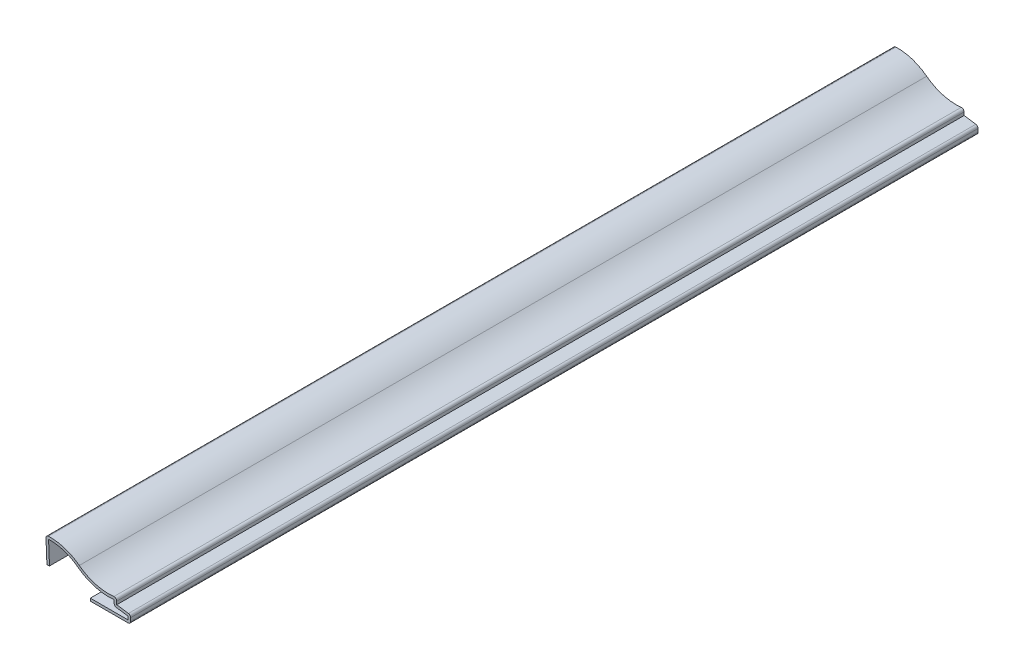
ISO-10303-21;
HEADER;
FILE_DESCRIPTION(('STEP AP214'),'2;1');
FILE_NAME('part.step','',(''),(''),'','','');
FILE_SCHEMA(('AUTOMOTIVE_DESIGN { 1 0 10303 214 1 1 1 1 }'));
ENDSEC;
DATA;
#1=APPLICATION_CONTEXT('core data for automotive mechanical design processes');
#2=APPLICATION_PROTOCOL_DEFINITION('international standard','automotive_design',2000,#1);
#3=PRODUCT_CONTEXT('',#1,'mechanical');
#4=PRODUCT('Part','Part','',(#3));
#5=PRODUCT_RELATED_PRODUCT_CATEGORY('part','',(#4));
#6=PRODUCT_DEFINITION_FORMATION('','',#4);
#7=PRODUCT_DEFINITION_CONTEXT('part definition',#1,'design');
#8=PRODUCT_DEFINITION('design','',#6,#7);
#9=PRODUCT_DEFINITION_SHAPE('','',#8);
#10=(LENGTH_UNIT() NAMED_UNIT(*) SI_UNIT(.MILLI.,.METRE.));
#11=(NAMED_UNIT(*) PLANE_ANGLE_UNIT() SI_UNIT($,.RADIAN.));
#12=(NAMED_UNIT(*) SI_UNIT($,.STERADIAN.) SOLID_ANGLE_UNIT());
#13=UNCERTAINTY_MEASURE_WITH_UNIT(LENGTH_MEASURE(1.E-05),#10,'distance_accuracy_value','');
#14=(GEOMETRIC_REPRESENTATION_CONTEXT(3) GLOBAL_UNCERTAINTY_ASSIGNED_CONTEXT((#13)) GLOBAL_UNIT_ASSIGNED_CONTEXT((#10,
#11,#12)) REPRESENTATION_CONTEXT('',''));
#15=CARTESIAN_POINT('',(0.,0.,0.));
#16=DIRECTION('',(0.,0.,1.));
#17=DIRECTION('',(1.,0.,0.));
#18=AXIS2_PLACEMENT_3D('',#15,#16,#17);
#19=CARTESIAN_POINT('',(32.940625,-2.88648892967346,-333.375));
#20=DIRECTION('',(0.,1.,0.));
#21=DIRECTION('',(-1.,0.,0.));
#22=AXIS2_PLACEMENT_3D('',#19,#20,#21);
#23=PLANE('',#22);
#24=DIRECTION('',(-1.,0.,0.));
#25=VECTOR('',#24,1.);
#26=CARTESIAN_POINT('',(32.940625,-2.88648892967346,0.));
#27=LINE('',#26,#25);
#28=CARTESIAN_POINT('',(31.924625,-2.88648892967346,0.));
#29=VERTEX_POINT('',#28);
#30=CARTESIAN_POINT('',(17.065625,-2.88648892967346,0.));
#31=VERTEX_POINT('',#30);
#32=EDGE_CURVE('E242',#29,#31,#27,.T.);
#33=ORIENTED_EDGE('',*,*,#32,.F.);
#34=DIRECTION('',(0.,0.,1.));
#35=VECTOR('',#34,1.);
#36=CARTESIAN_POINT('',(31.924625,-2.88648892967346,-333.375));
#37=LINE('',#36,#35);
#38=CARTESIAN_POINT('',(31.924625,-2.88648892967346,-333.375));
#39=VERTEX_POINT('',#38);
#40=EDGE_CURVE('E202',#39,#29,#37,.T.);
#41=ORIENTED_EDGE('',*,*,#40,.F.);
#42=DIRECTION('',(-1.,0.,0.));
#43=VECTOR('',#42,1.);
#44=CARTESIAN_POINT('',(32.940625,-2.88648892967346,-333.375));
#45=LINE('',#44,#43);
#46=CARTESIAN_POINT('',(17.065625,-2.88648892967346,-333.375));
#47=VERTEX_POINT('',#46);
#48=EDGE_CURVE('E184',#39,#47,#45,.T.);
#49=ORIENTED_EDGE('',*,*,#48,.T.);
#50=DIRECTION('',(0.,0.,1.));
#51=VECTOR('',#50,1.);
#52=CARTESIAN_POINT('',(17.065625,-2.88648892967346,-333.375));
#53=LINE('',#52,#51);
#54=EDGE_CURVE('E192',#47,#31,#53,.T.);
#55=ORIENTED_EDGE('',*,*,#54,.T.);
#56=EDGE_LOOP('',(#33,#41,#49,#55));
#57=FACE_BOUND('',#56,.T.);
#58=ADVANCED_FACE('F35',(#57),#23,.T.);
#59=CARTESIAN_POINT('',(31.924625,-0.727488929673456,-333.375));
#60=DIRECTION('',(-1.,0.,0.));
#61=DIRECTION('',(0.,-1.,0.));
#62=AXIS2_PLACEMENT_3D('',#59,#60,#61);
#63=PLANE('',#62);
#64=DIRECTION('',(0.,-1.,0.));
#65=VECTOR('',#64,1.);
#66=CARTESIAN_POINT('',(31.924625,-0.727488929673456,0.));
#67=LINE('',#66,#65);
#68=CARTESIAN_POINT('',(31.924625,-1.60664492581559,0.));
#69=VERTEX_POINT('',#68);
#70=EDGE_CURVE('E203',#69,#29,#67,.T.);
#71=ORIENTED_EDGE('',*,*,#70,.F.);
#72=DIRECTION('',(0.,0.,1.));
#73=VECTOR('',#72,1.);
#74=CARTESIAN_POINT('',(31.924625,-1.60664492581559,-333.375));
#75=LINE('',#74,#73);
#76=CARTESIAN_POINT('',(31.924625,-1.60664492581559,-333.375));
#77=VERTEX_POINT('',#76);
#78=EDGE_CURVE('E279',#77,#69,#75,.T.);
#79=ORIENTED_EDGE('',*,*,#78,.F.);
#80=DIRECTION('',(0.,-1.,0.));
#81=VECTOR('',#80,1.);
#82=CARTESIAN_POINT('',(31.924625,-0.727488929673456,-333.375));
#83=LINE('',#82,#81);
#84=EDGE_CURVE('E200',#77,#39,#83,.T.);
#85=ORIENTED_EDGE('',*,*,#84,.T.);
#86=ORIENTED_EDGE('',*,*,#40,.T.);
#87=EDGE_LOOP('',(#71,#79,#85,#86));
#88=FACE_BOUND('',#87,.T.);
#89=ADVANCED_FACE('F383',(#88),#63,.T.);
#90=CARTESIAN_POINT('',(27.3269864625744,-0.939199263849399,-333.375));
#91=DIRECTION('',(-0.143665445709355,-0.989626313165294,0.));
#92=DIRECTION('',(0.989626313165294,-0.143665445709355,0.));
#93=AXIS2_PLACEMENT_3D('',#90,#91,#92);
#94=PLANE('',#93);
#95=DIRECTION('',(0.989626313165294,-0.143665445709355,0.));
#96=VECTOR('',#95,1.);
#97=CARTESIAN_POINT('',(27.3269864625744,-0.939199263849399,0.));
#98=LINE('',#97,#96);
#99=CARTESIAN_POINT('',(27.3269864625744,-0.939199263849399,0.));
#100=VERTEX_POINT('',#99);
#101=EDGE_CURVE('E206',#100,#69,#98,.T.);
#102=ORIENTED_EDGE('',*,*,#101,.F.);
#103=DIRECTION('',(0.,0.,1.));
#104=VECTOR('',#103,1.);
#105=CARTESIAN_POINT('',(27.3269864625744,-0.939199263849399,-333.375));
#106=LINE('',#105,#104);
#107=CARTESIAN_POINT('',(27.3269864625744,-0.939199263849399,-333.375));
#108=VERTEX_POINT('',#107);
#109=EDGE_CURVE('E312',#100,#108,#106,.F.);
#110=ORIENTED_EDGE('',*,*,#109,.T.);
#111=DIRECTION('',(0.989626313165294,-0.143665445709355,0.));
#112=VECTOR('',#111,1.);
#113=CARTESIAN_POINT('',(27.3269864625744,-0.939199263849399,-333.375));
#114=LINE('',#113,#112);
#115=EDGE_CURVE('E239',#108,#77,#114,.T.);
#116=ORIENTED_EDGE('',*,*,#115,.T.);
#117=ORIENTED_EDGE('',*,*,#78,.T.);
#118=EDGE_LOOP('',(#102,#110,#116,#117));
#119=FACE_BOUND('',#118,.T.);
#120=ADVANCED_FACE('F424',(#119),#94,.T.);
#121=CARTESIAN_POINT('',(26.4569505554151,2.44751107032654,-333.375));
#122=DIRECTION('',(-1.,0.,0.));
#123=DIRECTION('',(0.,0.,1.));
#124=AXIS2_PLACEMENT_3D('',#121,#122,#123);
#125=PLANE('',#124);
#126=DIRECTION('',(0.,1.,0.));
#127=VECTOR('',#126,1.);
#128=CARTESIAN_POINT('',(26.4569505554151,2.44751107032654,-333.375));
#129=LINE('',#128,#127);
#130=CARTESIAN_POINT('',(26.4569505554151,1.28155122971346,-333.375));
#131=VERTEX_POINT('',#130);
#132=CARTESIAN_POINT('',(26.4569505554151,0.0662610703265395,-333.375));
#133=VERTEX_POINT('',#132);
#134=EDGE_CURVE('E236',#131,#133,#129,.F.);
#135=ORIENTED_EDGE('',*,*,#134,.T.);
#136=DIRECTION('',(0.,0.,1.));
#137=VECTOR('',#136,1.);
#138=CARTESIAN_POINT('',(26.4569505554151,0.0662610703265395,-333.375));
#139=LINE('',#138,#137);
#140=CARTESIAN_POINT('',(26.4569505554151,0.0662610703265395,0.));
#141=VERTEX_POINT('',#140);
#142=EDGE_CURVE('E278',#133,#141,#139,.T.);
#143=ORIENTED_EDGE('',*,*,#142,.T.);
#144=DIRECTION('',(0.,1.,0.));
#145=VECTOR('',#144,1.);
#146=CARTESIAN_POINT('',(26.4569505554151,2.44751107032654,0.));
#147=LINE('',#146,#145);
#148=CARTESIAN_POINT('',(26.4569505554151,1.28155122971346,0.));
#149=VERTEX_POINT('',#148);
#150=EDGE_CURVE('E273',#149,#141,#147,.F.);
#151=ORIENTED_EDGE('',*,*,#150,.F.);
#152=DIRECTION('',(0.,0.,1.));
#153=VECTOR('',#152,1.);
#154=CARTESIAN_POINT('',(26.4569505554151,1.28155122971346,-333.375));
#155=LINE('',#154,#153);
#156=EDGE_CURVE('E282',#131,#149,#155,.T.);
#157=ORIENTED_EDGE('',*,*,#156,.F.);
#158=EDGE_LOOP('',(#135,#143,#151,#157));
#159=FACE_BOUND('',#158,.T.);
#160=ADVANCED_FACE('F393',(#159),#125,.T.);
#161=CARTESIAN_POINT('',(24.2979505554151,21.2310643816678,-333.375));
#162=DIRECTION('',(0.,0.,1.));
#163=DIRECTION('',(1.,0.,0.));
#164=AXIS2_PLACEMENT_3D('',#161,#162,#163);
#165=CYLINDRICAL_SURFACE('',#164,20.066);
#166=CARTESIAN_POINT('',(24.2979505554151,21.2310643816678,0.));
#167=DIRECTION('',(0.,0.,1.));
#168=DIRECTION('',(1.,0.,0.));
#169=AXIS2_PLACEMENT_3D('',#166,#167,#168);
#170=CIRCLE('',#169,20.066);
#171=CARTESIAN_POINT('',(12.1280924295631,5.27678880436142,0.));
#172=VERTEX_POINT('',#171);
#173=EDGE_CURVE('E270',#172,#149,#170,.T.);
#174=ORIENTED_EDGE('',*,*,#173,.F.);
#175=DIRECTION('',(0.,0.,1.));
#176=VECTOR('',#175,1.);
#177=CARTESIAN_POINT('',(12.1280924295631,5.27678880436142,-333.375));
#178=LINE('',#177,#176);
#179=CARTESIAN_POINT('',(12.1280924295631,5.27678880436142,-333.375));
#180=VERTEX_POINT('',#179);
#181=EDGE_CURVE('E284',#180,#172,#178,.T.);
#182=ORIENTED_EDGE('',*,*,#181,.F.);
#183=CARTESIAN_POINT('',(24.2979505554151,21.2310643816678,-333.375));
#184=DIRECTION('',(0.,0.,1.));
#185=DIRECTION('',(1.,0.,0.));
#186=AXIS2_PLACEMENT_3D('',#183,#184,#185);
#187=CIRCLE('',#186,20.066);
#188=EDGE_CURVE('E233',#180,#131,#187,.T.);
#189=ORIENTED_EDGE('',*,*,#188,.T.);
#190=ORIENTED_EDGE('',*,*,#156,.T.);
#191=EDGE_LOOP('',(#174,#182,#189,#190));
#192=FACE_BOUND('',#191,.T.);
#193=ADVANCED_FACE('F397',(#192),#165,.T.);
#194=CARTESIAN_POINT('',(1.190625,-9.06186392967347,-333.375));
#195=DIRECTION('',(0.,0.,1.));
#196=DIRECTION('',(1.,0.,0.));
#197=AXIS2_PLACEMENT_3D('',#194,#195,#196);
#198=CYLINDRICAL_SURFACE('',#197,18.034);
#199=CARTESIAN_POINT('',(1.190625,-9.06186392967347,0.));
#200=DIRECTION('',(0.,0.,1.));
#201=DIRECTION('',(1.,0.,0.));
#202=AXIS2_PLACEMENT_3D('',#199,#200,#201);
#203=CIRCLE('',#202,18.034);
#204=CARTESIAN_POINT('',(0.658241431842194,8.96427608244104,0.));
#205=VERTEX_POINT('',#204);
#206=EDGE_CURVE('E267',#205,#172,#203,.F.);
#207=ORIENTED_EDGE('',*,*,#206,.F.);
#208=DIRECTION('',(0.,0.,1.));
#209=VECTOR('',#208,1.);
#210=CARTESIAN_POINT('',(0.658241431842194,8.96427608244104,-333.375));
#211=LINE('',#210,#209);
#212=CARTESIAN_POINT('',(0.658241431842194,8.96427608244104,-333.375));
#213=VERTEX_POINT('',#212);
#214=EDGE_CURVE('E286',#213,#205,#211,.T.);
#215=ORIENTED_EDGE('',*,*,#214,.F.);
#216=CARTESIAN_POINT('',(1.190625,-9.06186392967347,-333.375));
#217=DIRECTION('',(0.,0.,1.));
#218=DIRECTION('',(1.,0.,0.));
#219=AXIS2_PLACEMENT_3D('',#216,#217,#218);
#220=CIRCLE('',#219,18.034);
#221=EDGE_CURVE('E230',#213,#180,#220,.F.);
#222=ORIENTED_EDGE('',*,*,#221,.T.);
#223=ORIENTED_EDGE('',*,*,#181,.T.);
#224=EDGE_LOOP('',(#207,#215,#222,#223));
#225=FACE_BOUND('',#224,.T.);
#226=ADVANCED_FACE('F402',(#225),#198,.F.);
#227=CARTESIAN_POINT('',(1.01518817406134,0.0406075269624536,-333.375));
#228=DIRECTION('',(0.999200958721789,0.0399680383488717,0.));
#229=DIRECTION('',(-0.0399680383488717,0.999200958721789,0.));
#230=AXIS2_PLACEMENT_3D('',#227,#228,#229);
#231=PLANE('',#230);
#232=DIRECTION('',(-0.0399680383488717,0.999200958721789,0.));
#233=VECTOR('',#232,1.);
#234=CARTESIAN_POINT('',(1.01518817406134,0.0406075269624536,0.));
#235=LINE('',#234,#233);
#236=CARTESIAN_POINT('',(1.01518817406134,0.0406075269624536,0.));
#237=VERTEX_POINT('',#236);
#238=EDGE_CURVE('E264',#237,#205,#235,.T.);
#239=ORIENTED_EDGE('',*,*,#238,.F.);
#240=DIRECTION('',(0.,0.,1.));
#241=VECTOR('',#240,1.);
#242=CARTESIAN_POINT('',(1.01518817406134,0.0406075269624536,-333.375));
#243=LINE('',#242,#241);
#244=CARTESIAN_POINT('',(1.01518817406134,0.0406075269624536,-333.375));
#245=VERTEX_POINT('',#244);
#246=EDGE_CURVE('E288',#245,#237,#243,.T.);
#247=ORIENTED_EDGE('',*,*,#246,.F.);
#248=DIRECTION('',(-0.0399680383488717,0.999200958721789,0.));
#249=VECTOR('',#248,1.);
#250=CARTESIAN_POINT('',(1.01518817406134,0.0406075269624536,-333.375));
#251=LINE('',#250,#249);
#252=EDGE_CURVE('E227',#245,#213,#251,.T.);
#253=ORIENTED_EDGE('',*,*,#252,.T.);
#254=ORIENTED_EDGE('',*,*,#214,.T.);
#255=EDGE_LOOP('',(#239,#247,#253,#254));
#256=FACE_BOUND('',#255,.T.);
#257=ADVANCED_FACE('F405',(#256),#231,.T.);
#258=CARTESIAN_POINT('',(1.01518817406134,0.0406075269624536,-333.375));
#259=DIRECTION('',(-0.0399680383488717,0.999200958721789,0.));
#260=DIRECTION('',(-0.999200958721789,-0.0399680383488717,0.));
#261=AXIS2_PLACEMENT_3D('',#258,#259,#260);
#262=PLANE('',#261);
#263=DIRECTION('',(-0.999200958721789,-0.0399680383488717,0.));
#264=VECTOR('',#263,1.);
#265=CARTESIAN_POINT('',(1.01518817406134,0.0406075269624536,0.));
#266=LINE('',#265,#264);
#267=CARTESIAN_POINT('',(0.,0.,0.));
#268=VERTEX_POINT('',#267);
#269=EDGE_CURVE('E262',#237,#268,#266,.T.);
#270=ORIENTED_EDGE('',*,*,#269,.T.);
#271=DIRECTION('',(0.,0.,1.));
#272=VECTOR('',#271,1.);
#273=CARTESIAN_POINT('',(0.,0.,-333.375));
#274=LINE('',#273,#272);
#275=CARTESIAN_POINT('',(0.,0.,-333.375));
#276=VERTEX_POINT('',#275);
#277=EDGE_CURVE('E290',#276,#268,#274,.T.);
#278=ORIENTED_EDGE('',*,*,#277,.F.);
#279=DIRECTION('',(-0.999200958721789,-0.0399680383488717,0.));
#280=VECTOR('',#279,1.);
#281=CARTESIAN_POINT('',(1.01518817406134,0.0406075269624536,-333.375));
#282=LINE('',#281,#280);
#283=EDGE_CURVE('E225',#245,#276,#282,.T.);
#284=ORIENTED_EDGE('',*,*,#283,.F.);
#285=ORIENTED_EDGE('',*,*,#246,.T.);
#286=EDGE_LOOP('',(#270,#278,#284,#285));
#287=FACE_BOUND('',#286,.T.);
#288=ADVANCED_FACE('F410',(#287),#262,.F.);
#289=CARTESIAN_POINT('',(0.,0.,-333.375));
#290=DIRECTION('',(0.999200958721789,0.0399680383488717,0.));
#291=DIRECTION('',(-0.0399680383488717,0.99920095872179,0.));
#292=AXIS2_PLACEMENT_3D('',#289,#290,#291);
#293=PLANE('',#292);
#294=DIRECTION('',(-0.0399680383488717,0.99920095872179,0.));
#295=VECTOR('',#294,1.);
#296=CARTESIAN_POINT('',(0.,0.,0.));
#297=LINE('',#296,#295);
#298=CARTESIAN_POINT('',(-0.356946742219144,8.92366855547858,0.));
#299=VERTEX_POINT('',#298);
#300=EDGE_CURVE('E259',#268,#299,#297,.T.);
#301=ORIENTED_EDGE('',*,*,#300,.T.);
#302=DIRECTION('',(0.,0.,1.));
#303=VECTOR('',#302,1.);
#304=CARTESIAN_POINT('',(-0.356946742219144,8.92366855547858,-333.375));
#305=LINE('',#304,#303);
#306=CARTESIAN_POINT('',(-0.356946742219144,8.92366855547858,-333.375));
#307=VERTEX_POINT('',#306);
#308=EDGE_CURVE('E11',#299,#307,#305,.F.);
#309=ORIENTED_EDGE('',*,*,#308,.T.);
#310=DIRECTION('',(-0.0399680383488717,0.99920095872179,0.));
#311=VECTOR('',#310,1.);
#312=CARTESIAN_POINT('',(0.,0.,-333.375));
#313=LINE('',#312,#311);
#314=EDGE_CURVE('E222',#276,#307,#313,.T.);
#315=ORIENTED_EDGE('',*,*,#314,.F.);
#316=ORIENTED_EDGE('',*,*,#277,.T.);
#317=EDGE_LOOP('',(#301,#309,#315,#316));
#318=FACE_BOUND('',#317,.T.);
#319=ADVANCED_FACE('F413',(#318),#293,.F.);
#320=CARTESIAN_POINT('',(1.190625,-9.06186392967347,-333.375));
#321=DIRECTION('',(0.,0.,1.));
#322=DIRECTION('',(1.,0.,0.));
#323=AXIS2_PLACEMENT_3D('',#320,#321,#322);
#324=CYLINDRICAL_SURFACE('',#323,19.05);
#325=CARTESIAN_POINT('',(1.190625,-9.06186392967347,-333.375));
#326=DIRECTION('',(0.,0.,-1.));
#327=DIRECTION('',(-1.,0.,0.));
#328=AXIS2_PLACEMENT_3D('',#325,#326,#327);
#329=CIRCLE('',#328,19.05);
#330=CARTESIAN_POINT('',(0.628247991382599,9.97983326622213,-333.375));
#331=VERTEX_POINT('',#330);
#332=CARTESIAN_POINT('',(12.7442877777075,6.08460022599717,-333.375));
#333=VERTEX_POINT('',#332);
#334=EDGE_CURVE('E220',#331,#333,#329,.T.);
#335=ORIENTED_EDGE('',*,*,#334,.F.);
#336=DIRECTION('',(0.,0.,1.));
#337=VECTOR('',#336,1.);
#338=CARTESIAN_POINT('',(0.628247991382599,9.97983326622214,-333.375));
#339=LINE('',#338,#337);
#340=CARTESIAN_POINT('',(0.628247991382599,9.97983326622213,0.));
#341=VERTEX_POINT('',#340);
#342=EDGE_CURVE('E43',#331,#341,#339,.T.);
#343=ORIENTED_EDGE('',*,*,#342,.T.);
#344=CARTESIAN_POINT('',(1.190625,-9.06186392967347,0.));
#345=DIRECTION('',(0.,0.,-1.));
#346=DIRECTION('',(-1.,0.,0.));
#347=AXIS2_PLACEMENT_3D('',#344,#345,#346);
#348=CIRCLE('',#347,19.05);
#349=CARTESIAN_POINT('',(12.7442877777075,6.08460022599717,0.));
#350=VERTEX_POINT('',#349);
#351=EDGE_CURVE('E257',#341,#350,#348,.T.);
#352=ORIENTED_EDGE('',*,*,#351,.T.);
#353=DIRECTION('',(0.,0.,1.));
#354=VECTOR('',#353,1.);
#355=CARTESIAN_POINT('',(12.7442877777075,6.08460022599717,-333.375));
#356=LINE('',#355,#354);
#357=EDGE_CURVE('E293',#333,#350,#356,.T.);
#358=ORIENTED_EDGE('',*,*,#357,.F.);
#359=EDGE_LOOP('',(#335,#343,#352,#358));
#360=FACE_BOUND('',#359,.T.);
#361=ADVANCED_FACE('F341',(#360),#324,.T.);
#362=CARTESIAN_POINT('',(24.2979505554151,21.2310643816678,-333.375));
#363=DIRECTION('',(0.,0.,1.));
#364=DIRECTION('',(1.,0.,0.));
#365=AXIS2_PLACEMENT_3D('',#362,#363,#364);
#366=CYLINDRICAL_SURFACE('',#365,19.05);
#367=CARTESIAN_POINT('',(24.2979505554151,21.2310643816678,0.));
#368=DIRECTION('',(0.,0.,1.));
#369=DIRECTION('',(1.,0.,0.));
#370=AXIS2_PLACEMENT_3D('',#367,#368,#369);
#371=CIRCLE('',#370,19.05);
#372=CARTESIAN_POINT('',(26.3476340997189,2.29165316145798,0.));
#373=VERTEX_POINT('',#372);
#374=EDGE_CURVE('E254',#350,#373,#371,.T.);
#375=ORIENTED_EDGE('',*,*,#374,.T.);
#376=DIRECTION('',(0.,0.,1.));
#377=VECTOR('',#376,1.);
#378=CARTESIAN_POINT('',(26.3476340997189,2.29165316145798,-333.375));
#379=LINE('',#378,#377);
#380=CARTESIAN_POINT('',(26.3476340997189,2.29165316145798,-333.375));
#381=VERTEX_POINT('',#380);
#382=EDGE_CURVE('E335',#373,#381,#379,.F.);
#383=ORIENTED_EDGE('',*,*,#382,.T.);
#384=CARTESIAN_POINT('',(24.2979505554151,21.2310643816678,-333.375));
#385=DIRECTION('',(0.,0.,1.));
#386=DIRECTION('',(1.,0.,0.));
#387=AXIS2_PLACEMENT_3D('',#384,#385,#386);
#388=CIRCLE('',#387,19.05);
#389=EDGE_CURVE('E217',#333,#381,#388,.T.);
#390=ORIENTED_EDGE('',*,*,#389,.F.);
#391=ORIENTED_EDGE('',*,*,#357,.T.);
#392=EDGE_LOOP('',(#375,#383,#390,#391));
#393=FACE_BOUND('',#392,.T.);
#394=ADVANCED_FACE('F352',(#393),#366,.F.);
#395=CARTESIAN_POINT('',(27.4729505554151,2.44751107032654,-333.375));
#396=DIRECTION('',(-1.,0.,0.));
#397=DIRECTION('',(0.,0.,1.));
#398=AXIS2_PLACEMENT_3D('',#395,#396,#397);
#399=PLANE('',#398);
#400=DIRECTION('',(0.,-1.,0.));
#401=VECTOR('',#400,1.);
#402=CARTESIAN_POINT('',(27.4729505554151,2.44751107032654,-333.375));
#403=LINE('',#402,#401);
#404=CARTESIAN_POINT('',(27.4729505554151,1.28155122971346,-333.375));
#405=VERTEX_POINT('',#404);
#406=CARTESIAN_POINT('',(27.4729505554151,0.0662610703265393,-333.375));
#407=VERTEX_POINT('',#406);
#408=EDGE_CURVE('E215',#405,#407,#403,.T.);
#409=ORIENTED_EDGE('',*,*,#408,.F.);
#410=DIRECTION('',(0.,0.,1.));
#411=VECTOR('',#410,1.);
#412=CARTESIAN_POINT('',(27.4729505554151,1.28155122971346,-333.375));
#413=LINE('',#412,#411);
#414=CARTESIAN_POINT('',(27.4729505554151,1.28155122971346,0.));
#415=VERTEX_POINT('',#414);
#416=EDGE_CURVE('E332',#405,#415,#413,.T.);
#417=ORIENTED_EDGE('',*,*,#416,.T.);
#418=DIRECTION('',(0.,-1.,0.));
#419=VECTOR('',#418,1.);
#420=CARTESIAN_POINT('',(27.4729505554151,2.44751107032654,0.));
#421=LINE('',#420,#419);
#422=CARTESIAN_POINT('',(27.4729505554151,0.0662610703265393,0.));
#423=VERTEX_POINT('',#422);
#424=EDGE_CURVE('E252',#415,#423,#421,.T.);
#425=ORIENTED_EDGE('',*,*,#424,.T.);
#426=DIRECTION('',(0.,0.,1.));
#427=VECTOR('',#426,1.);
#428=CARTESIAN_POINT('',(27.4729505554151,0.0662610703265393,-333.375));
#429=LINE('',#428,#427);
#430=EDGE_CURVE('E296',#407,#423,#429,.T.);
#431=ORIENTED_EDGE('',*,*,#430,.F.);
#432=EDGE_LOOP('',(#409,#417,#425,#431));
#433=FACE_BOUND('',#432,.T.);
#434=ADVANCED_FACE('F361',(#433),#399,.F.);
#435=CARTESIAN_POINT('',(27.4729505554151,0.0662610703265393,-333.375));
#436=DIRECTION('',(-0.143665445709355,-0.989626313165294,0.));
#437=DIRECTION('',(0.989626313165294,-0.143665445709355,0.));
#438=AXIS2_PLACEMENT_3D('',#435,#436,#437);
#439=PLANE('',#438);
#440=DIRECTION('',(0.989626313165294,-0.143665445709355,0.));
#441=VECTOR('',#440,1.);
#442=CARTESIAN_POINT('',(27.4729505554151,0.0662610703265393,0.));
#443=LINE('',#442,#441);
#444=CARTESIAN_POINT('',(32.0705890928407,-0.601184591639647,0.));
#445=VERTEX_POINT('',#444);
#446=EDGE_CURVE('E249',#423,#445,#443,.T.);
#447=ORIENTED_EDGE('',*,*,#446,.T.);
#448=DIRECTION('',(0.,0.,1.));
#449=VECTOR('',#448,1.);
#450=CARTESIAN_POINT('',(32.0705890928407,-0.601184591639647,-333.375));
#451=LINE('',#450,#449);
#452=CARTESIAN_POINT('',(32.0705890928407,-0.601184591639647,-333.375));
#453=VERTEX_POINT('',#452);
#454=EDGE_CURVE('E330',#445,#453,#451,.F.);
#455=ORIENTED_EDGE('',*,*,#454,.T.);
#456=DIRECTION('',(0.989626313165294,-0.143665445709355,0.));
#457=VECTOR('',#456,1.);
#458=CARTESIAN_POINT('',(27.4729505554151,0.0662610703265393,-333.375));
#459=LINE('',#458,#457);
#460=EDGE_CURVE('E212',#407,#453,#459,.T.);
#461=ORIENTED_EDGE('',*,*,#460,.F.);
#462=ORIENTED_EDGE('',*,*,#430,.T.);
#463=EDGE_LOOP('',(#447,#455,#461,#462));
#464=FACE_BOUND('',#463,.T.);
#465=ADVANCED_FACE('F365',(#464),#439,.F.);
#466=CARTESIAN_POINT('',(32.940625,-0.727488929673458,-333.375));
#467=DIRECTION('',(-1.,0.,0.));
#468=DIRECTION('',(0.,-1.,0.));
#469=AXIS2_PLACEMENT_3D('',#466,#467,#468);
#470=PLANE('',#469);
#471=DIRECTION('',(0.,-1.,0.));
#472=VECTOR('',#471,1.);
#473=CARTESIAN_POINT('',(32.940625,-0.727488929673458,0.));
#474=LINE('',#473,#472);
#475=CARTESIAN_POINT('',(32.940625,-1.60664492581559,0.));
#476=VERTEX_POINT('',#475);
#477=CARTESIAN_POINT('',(32.940625,-2.88648892967346,0.));
#478=VERTEX_POINT('',#477);
#479=EDGE_CURVE('E247',#476,#478,#474,.T.);
#480=ORIENTED_EDGE('',*,*,#479,.T.);
#481=DIRECTION('',(0.,0.,1.));
#482=VECTOR('',#481,1.);
#483=CARTESIAN_POINT('',(32.940625,-2.88648892967346,-333.375));
#484=LINE('',#483,#482);
#485=CARTESIAN_POINT('',(32.940625,-2.88648892967346,-333.375));
#486=VERTEX_POINT('',#485);
#487=EDGE_CURVE('E58',#478,#486,#484,.F.);
#488=ORIENTED_EDGE('',*,*,#487,.T.);
#489=DIRECTION('',(0.,-1.,0.));
#490=VECTOR('',#489,1.);
#491=CARTESIAN_POINT('',(32.940625,-0.727488929673458,-333.375));
#492=LINE('',#491,#490);
#493=CARTESIAN_POINT('',(32.940625,-1.60664492581559,-333.375));
#494=VERTEX_POINT('',#493);
#495=EDGE_CURVE('E210',#494,#486,#492,.T.);
#496=ORIENTED_EDGE('',*,*,#495,.F.);
#497=DIRECTION('',(0.,0.,1.));
#498=VECTOR('',#497,1.);
#499=CARTESIAN_POINT('',(32.940625,-1.60664492581559,-333.375));
#500=LINE('',#499,#498);
#501=EDGE_CURVE('E326',#494,#476,#500,.T.);
#502=ORIENTED_EDGE('',*,*,#501,.T.);
#503=EDGE_LOOP('',(#480,#488,#496,#502));
#504=FACE_BOUND('',#503,.T.);
#505=ADVANCED_FACE('F372',(#504),#470,.F.);
#506=CARTESIAN_POINT('',(32.940625,-3.90248892967346,-333.375));
#507=DIRECTION('',(0.,1.,0.));
#508=DIRECTION('',(-1.,0.,0.));
#509=AXIS2_PLACEMENT_3D('',#506,#507,#508);
#510=PLANE('',#509);
#511=DIRECTION('',(-1.,0.,0.));
#512=VECTOR('',#511,1.);
#513=CARTESIAN_POINT('',(32.940625,-3.90248892967346,-333.375));
#514=LINE('',#513,#512);
#515=CARTESIAN_POINT('',(31.924625,-3.90248892967346,-333.375));
#516=VERTEX_POINT('',#515);
#517=CARTESIAN_POINT('',(17.065625,-3.90248892967346,-333.375));
#518=VERTEX_POINT('',#517);
#519=EDGE_CURVE('E186',#516,#518,#514,.T.);
#520=ORIENTED_EDGE('',*,*,#519,.F.);
#521=DIRECTION('',(0.,0.,1.));
#522=VECTOR('',#521,1.);
#523=CARTESIAN_POINT('',(31.924625,-3.90248892967346,-333.375));
#524=LINE('',#523,#522);
#525=CARTESIAN_POINT('',(31.924625,-3.90248892967346,0.));
#526=VERTEX_POINT('',#525);
#527=EDGE_CURVE('E323',#516,#526,#524,.T.);
#528=ORIENTED_EDGE('',*,*,#527,.T.);
#529=DIRECTION('',(-1.,0.,0.));
#530=VECTOR('',#529,1.);
#531=CARTESIAN_POINT('',(32.940625,-3.90248892967346,0.));
#532=LINE('',#531,#530);
#533=CARTESIAN_POINT('',(17.065625,-3.90248892967346,0.));
#534=VERTEX_POINT('',#533);
#535=EDGE_CURVE('E245',#526,#534,#532,.T.);
#536=ORIENTED_EDGE('',*,*,#535,.T.);
#537=DIRECTION('',(0.,0.,1.));
#538=VECTOR('',#537,1.);
#539=CARTESIAN_POINT('',(17.065625,-3.90248892967346,-333.375));
#540=LINE('',#539,#538);
#541=EDGE_CURVE('E199',#518,#534,#540,.T.);
#542=ORIENTED_EDGE('',*,*,#541,.F.);
#543=EDGE_LOOP('',(#520,#528,#536,#542));
#544=FACE_BOUND('',#543,.T.);
#545=ADVANCED_FACE('F378',(#544),#510,.F.);
#546=CARTESIAN_POINT('',(17.065625,-3.90248892967346,-333.375));
#547=DIRECTION('',(1.,0.,0.));
#548=DIRECTION('',(0.,0.,-1.));
#549=AXIS2_PLACEMENT_3D('',#546,#547,#548);
#550=PLANE('',#549);
#551=DIRECTION('',(0.,1.,0.));
#552=VECTOR('',#551,1.);
#553=CARTESIAN_POINT('',(17.065625,-3.90248892967346,0.));
#554=LINE('',#553,#552);
#555=EDGE_CURVE('E195',#534,#31,#554,.T.);
#556=ORIENTED_EDGE('',*,*,#555,.T.);
#557=ORIENTED_EDGE('',*,*,#54,.F.);
#558=DIRECTION('',(0.,1.,0.));
#559=VECTOR('',#558,1.);
#560=CARTESIAN_POINT('',(17.065625,-3.90248892967346,-333.375));
#561=LINE('',#560,#559);
#562=EDGE_CURVE('E178',#518,#47,#561,.T.);
#563=ORIENTED_EDGE('',*,*,#562,.F.);
#564=ORIENTED_EDGE('',*,*,#541,.T.);
#565=EDGE_LOOP('',(#556,#557,#563,#564));
#566=FACE_BOUND('',#565,.T.);
#567=ADVANCED_FACE('F193',(#566),#550,.F.);
#568=CARTESIAN_POINT('',(24.2979505554151,21.2310643816678,-333.375));
#569=DIRECTION('',(0.,0.,1.));
#570=DIRECTION('',(1.,0.,0.));
#571=AXIS2_PLACEMENT_3D('',#568,#569,#570);
#572=PLANE('',#571);
#573=ORIENTED_EDGE('',*,*,#115,.F.);
#574=CARTESIAN_POINT('',(27.4729505554151,0.0662610703265395,-333.375));
#575=DIRECTION('',(0.,0.,1.));
#576=DIRECTION('',(1.,0.,0.));
#577=AXIS2_PLACEMENT_3D('',#574,#575,#576);
#578=CIRCLE('',#577,1.016);
#579=EDGE_CURVE('E321',#108,#133,#578,.F.);
#580=ORIENTED_EDGE('',*,*,#579,.T.);
#581=ORIENTED_EDGE('',*,*,#134,.F.);
#582=ORIENTED_EDGE('',*,*,#188,.F.);
#583=ORIENTED_EDGE('',*,*,#221,.F.);
#584=ORIENTED_EDGE('',*,*,#252,.F.);
#585=ORIENTED_EDGE('',*,*,#283,.T.);
#586=ORIENTED_EDGE('',*,*,#314,.T.);
#587=CARTESIAN_POINT('',(0.658241431842194,8.96427608244103,-333.375));
#588=DIRECTION('',(0.,0.,1.));
#589=DIRECTION('',(1.,0.,0.));
#590=AXIS2_PLACEMENT_3D('',#587,#588,#589);
#591=CIRCLE('',#590,1.016);
#592=EDGE_CURVE('E314',#307,#331,#591,.F.);
#593=ORIENTED_EDGE('',*,*,#592,.T.);
#594=ORIENTED_EDGE('',*,*,#334,.T.);
#595=ORIENTED_EDGE('',*,*,#389,.T.);
#596=CARTESIAN_POINT('',(26.4569505554151,1.28155122971346,-333.375));
#597=DIRECTION('',(0.,0.,1.));
#598=DIRECTION('',(1.,0.,0.));
#599=AXIS2_PLACEMENT_3D('',#596,#597,#598);
#600=CIRCLE('',#599,1.016);
#601=EDGE_CURVE('E316',#381,#405,#600,.F.);
#602=ORIENTED_EDGE('',*,*,#601,.T.);
#603=ORIENTED_EDGE('',*,*,#408,.T.);
#604=ORIENTED_EDGE('',*,*,#460,.T.);
#605=CARTESIAN_POINT('',(31.924625,-1.60664492581559,-333.375));
#606=DIRECTION('',(0.,0.,1.));
#607=DIRECTION('',(1.,0.,0.));
#608=AXIS2_PLACEMENT_3D('',#605,#606,#607);
#609=CIRCLE('',#608,1.016);
#610=EDGE_CURVE('E318',#453,#494,#609,.F.);
#611=ORIENTED_EDGE('',*,*,#610,.T.);
#612=ORIENTED_EDGE('',*,*,#495,.T.);
#613=CARTESIAN_POINT('',(31.924625,-2.88648892967346,-333.375));
#614=DIRECTION('',(0.,0.,1.));
#615=DIRECTION('',(1.,0.,0.));
#616=AXIS2_PLACEMENT_3D('',#613,#614,#615);
#617=CIRCLE('',#616,1.016);
#618=EDGE_CURVE('E50',#486,#516,#617,.F.);
#619=ORIENTED_EDGE('',*,*,#618,.T.);
#620=ORIENTED_EDGE('',*,*,#519,.T.);
#621=ORIENTED_EDGE('',*,*,#562,.T.);
#622=ORIENTED_EDGE('',*,*,#48,.F.);
#623=ORIENTED_EDGE('',*,*,#84,.F.);
#624=EDGE_LOOP('',(#573,#580,#581,#582,#583,#584,#585,#586,#593,#594,#595,#602,#603,#604,#611,
#612,#619,#620,#621,#622,#623));
#625=FACE_BOUND('',#624,.T.);
#626=ADVANCED_FACE('F181',(#625),#572,.F.);
#627=CARTESIAN_POINT('',(24.2979505554151,21.2310643816678,0.));
#628=DIRECTION('',(0.,0.,1.));
#629=DIRECTION('',(1.,0.,0.));
#630=AXIS2_PLACEMENT_3D('',#627,#628,#629);
#631=PLANE('',#630);
#632=ORIENTED_EDGE('',*,*,#150,.T.);
#633=CARTESIAN_POINT('',(27.4729505554151,0.0662610703265395,0.));
#634=DIRECTION('',(0.,0.,1.));
#635=DIRECTION('',(1.,0.,0.));
#636=AXIS2_PLACEMENT_3D('',#633,#634,#635);
#637=CIRCLE('',#636,1.016);
#638=EDGE_CURVE('E310',#141,#100,#637,.T.);
#639=ORIENTED_EDGE('',*,*,#638,.T.);
#640=ORIENTED_EDGE('',*,*,#101,.T.);
#641=ORIENTED_EDGE('',*,*,#70,.T.);
#642=ORIENTED_EDGE('',*,*,#32,.T.);
#643=ORIENTED_EDGE('',*,*,#555,.F.);
#644=ORIENTED_EDGE('',*,*,#535,.F.);
#645=CARTESIAN_POINT('',(31.924625,-2.88648892967346,0.));
#646=DIRECTION('',(0.,0.,1.));
#647=DIRECTION('',(1.,0.,0.));
#648=AXIS2_PLACEMENT_3D('',#645,#646,#647);
#649=CIRCLE('',#648,1.016);
#650=EDGE_CURVE('E308',#526,#478,#649,.T.);
#651=ORIENTED_EDGE('',*,*,#650,.T.);
#652=ORIENTED_EDGE('',*,*,#479,.F.);
#653=CARTESIAN_POINT('',(31.924625,-1.60664492581559,0.));
#654=DIRECTION('',(0.,0.,1.));
#655=DIRECTION('',(1.,0.,0.));
#656=AXIS2_PLACEMENT_3D('',#653,#654,#655);
#657=CIRCLE('',#656,1.016);
#658=EDGE_CURVE('E306',#476,#445,#657,.T.);
#659=ORIENTED_EDGE('',*,*,#658,.T.);
#660=ORIENTED_EDGE('',*,*,#446,.F.);
#661=ORIENTED_EDGE('',*,*,#424,.F.);
#662=CARTESIAN_POINT('',(26.4569505554151,1.28155122971346,0.));
#663=DIRECTION('',(0.,0.,1.));
#664=DIRECTION('',(1.,0.,0.));
#665=AXIS2_PLACEMENT_3D('',#662,#663,#664);
#666=CIRCLE('',#665,1.016);
#667=EDGE_CURVE('E304',#415,#373,#666,.T.);
#668=ORIENTED_EDGE('',*,*,#667,.T.);
#669=ORIENTED_EDGE('',*,*,#374,.F.);
#670=ORIENTED_EDGE('',*,*,#351,.F.);
#671=CARTESIAN_POINT('',(0.658241431842194,8.96427608244103,0.));
#672=DIRECTION('',(0.,0.,1.));
#673=DIRECTION('',(1.,0.,0.));
#674=AXIS2_PLACEMENT_3D('',#671,#672,#673);
#675=CIRCLE('',#674,1.016);
#676=EDGE_CURVE('E302',#341,#299,#675,.T.);
#677=ORIENTED_EDGE('',*,*,#676,.T.);
#678=ORIENTED_EDGE('',*,*,#300,.F.);
#679=ORIENTED_EDGE('',*,*,#269,.F.);
#680=ORIENTED_EDGE('',*,*,#238,.T.);
#681=ORIENTED_EDGE('',*,*,#206,.T.);
#682=ORIENTED_EDGE('',*,*,#173,.T.);
#683=EDGE_LOOP('',(#632,#639,#640,#641,#642,#643,#644,#651,#652,#659,#660,#661,#668,#669,#670,
#677,#678,#679,#680,#681,#682));
#684=FACE_BOUND('',#683,.T.);
#685=ADVANCED_FACE('F347',(#684),#631,.T.);
#686=CARTESIAN_POINT('',(27.4729505554151,0.0662610703265395,-333.375));
#687=DIRECTION('',(0.,0.,1.));
#688=DIRECTION('',(1.,0.,0.));
#689=AXIS2_PLACEMENT_3D('',#686,#687,#688);
#690=CYLINDRICAL_SURFACE('',#689,1.016);
#691=ORIENTED_EDGE('',*,*,#579,.F.);
#692=ORIENTED_EDGE('',*,*,#109,.F.);
#693=ORIENTED_EDGE('',*,*,#638,.F.);
#694=ORIENTED_EDGE('',*,*,#142,.F.);
#695=EDGE_LOOP('',(#691,#692,#693,#694));
#696=FACE_BOUND('',#695,.T.);
#697=ADVANCED_FACE('F390',(#696),#690,.T.);
#698=CARTESIAN_POINT('',(31.924625,-2.88648892967346,-333.375));
#699=DIRECTION('',(0.,0.,1.));
#700=DIRECTION('',(1.,0.,0.));
#701=AXIS2_PLACEMENT_3D('',#698,#699,#700);
#702=CYLINDRICAL_SURFACE('',#701,1.016);
#703=ORIENTED_EDGE('',*,*,#618,.F.);
#704=ORIENTED_EDGE('',*,*,#487,.F.);
#705=ORIENTED_EDGE('',*,*,#650,.F.);
#706=ORIENTED_EDGE('',*,*,#527,.F.);
#707=EDGE_LOOP('',(#703,#704,#705,#706));
#708=FACE_BOUND('',#707,.T.);
#709=ADVANCED_FACE('F376',(#708),#702,.T.);
#710=CARTESIAN_POINT('',(31.924625,-1.60664492581559,-333.375));
#711=DIRECTION('',(0.,0.,1.));
#712=DIRECTION('',(1.,0.,0.));
#713=AXIS2_PLACEMENT_3D('',#710,#711,#712);
#714=CYLINDRICAL_SURFACE('',#713,1.016);
#715=ORIENTED_EDGE('',*,*,#610,.F.);
#716=ORIENTED_EDGE('',*,*,#454,.F.);
#717=ORIENTED_EDGE('',*,*,#658,.F.);
#718=ORIENTED_EDGE('',*,*,#501,.F.);
#719=EDGE_LOOP('',(#715,#716,#717,#718));
#720=FACE_BOUND('',#719,.T.);
#721=ADVANCED_FACE('F370',(#720),#714,.T.);
#722=CARTESIAN_POINT('',(26.4569505554151,1.28155122971346,-333.375));
#723=DIRECTION('',(0.,0.,1.));
#724=DIRECTION('',(1.,0.,0.));
#725=AXIS2_PLACEMENT_3D('',#722,#723,#724);
#726=CYLINDRICAL_SURFACE('',#725,1.016);
#727=ORIENTED_EDGE('',*,*,#601,.F.);
#728=ORIENTED_EDGE('',*,*,#382,.F.);
#729=ORIENTED_EDGE('',*,*,#667,.F.);
#730=ORIENTED_EDGE('',*,*,#416,.F.);
#731=EDGE_LOOP('',(#727,#728,#729,#730));
#732=FACE_BOUND('',#731,.T.);
#733=ADVANCED_FACE('F356',(#732),#726,.T.);
#734=CARTESIAN_POINT('',(0.658241431842194,8.96427608244103,-333.375));
#735=DIRECTION('',(0.,0.,1.));
#736=DIRECTION('',(1.,0.,0.));
#737=AXIS2_PLACEMENT_3D('',#734,#735,#736);
#738=CYLINDRICAL_SURFACE('',#737,1.016);
#739=ORIENTED_EDGE('',*,*,#592,.F.);
#740=ORIENTED_EDGE('',*,*,#308,.F.);
#741=ORIENTED_EDGE('',*,*,#676,.F.);
#742=ORIENTED_EDGE('',*,*,#342,.F.);
#743=EDGE_LOOP('',(#739,#740,#741,#742));
#744=FACE_BOUND('',#743,.T.);
#745=ADVANCED_FACE('F37',(#744),#738,.T.);
#746=CLOSED_SHELL('',(#58,#89,#120,#160,#193,#226,#257,#288,#319,#361,#394,#434,#465,#505,#545,
#567,#626,#685,#697,#709,#721,#733,#745));
#747=MANIFOLD_SOLID_BREP('B2',#746);
#748=ADVANCED_BREP_SHAPE_REPRESENTATION('',(#18,#747),#14);
#749=SHAPE_DEFINITION_REPRESENTATION(#9,#748);
ENDSEC;
END-ISO-10303-21;
